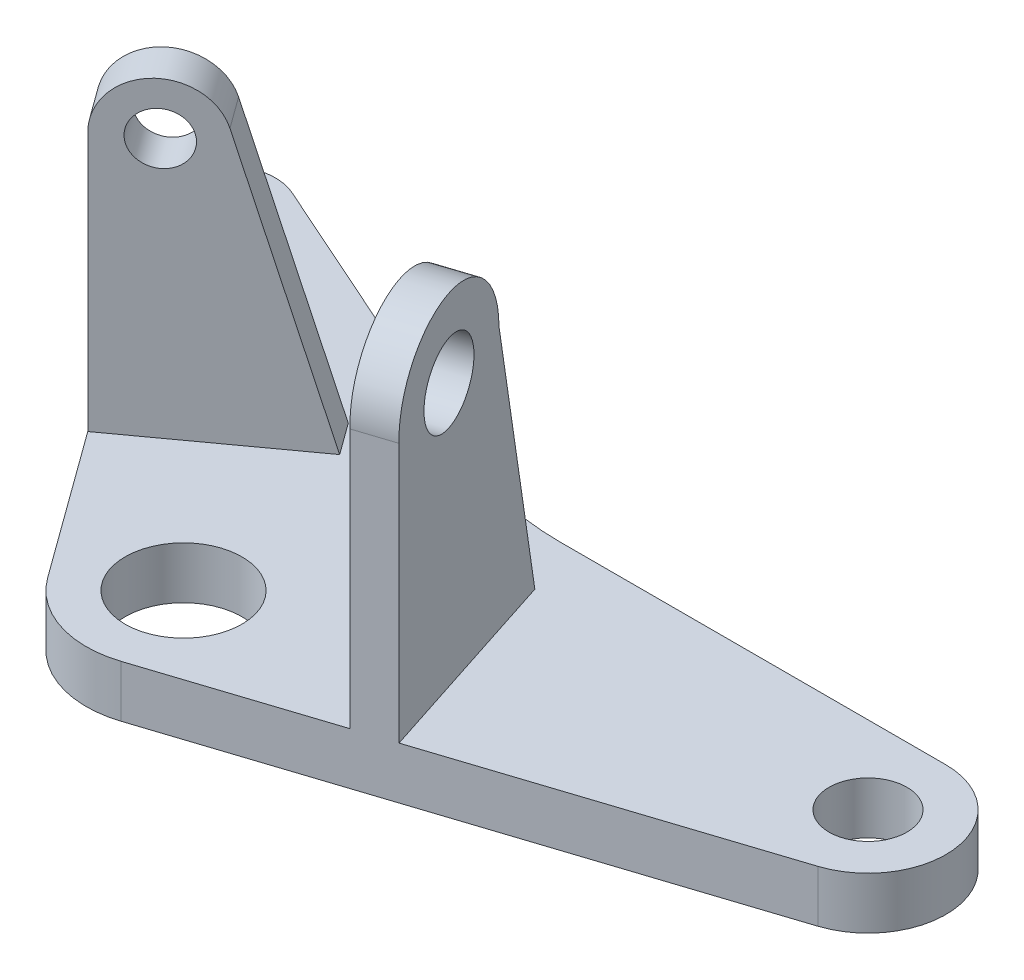
ISO-10303-21;
HEADER;
FILE_DESCRIPTION(('STEP AP214'),'2;1');
FILE_NAME('part.step','',(''),(''),'','','');
FILE_SCHEMA(('AUTOMOTIVE_DESIGN { 1 0 10303 214 1 1 1 1 }'));
ENDSEC;
DATA;
#1=APPLICATION_CONTEXT('core data for automotive mechanical design processes');
#2=APPLICATION_PROTOCOL_DEFINITION('international standard','automotive_design',2000,#1);
#3=PRODUCT_CONTEXT('',#1,'mechanical');
#4=PRODUCT('Part','Part','',(#3));
#5=PRODUCT_RELATED_PRODUCT_CATEGORY('part','',(#4));
#6=PRODUCT_DEFINITION_FORMATION('','',#4);
#7=PRODUCT_DEFINITION_CONTEXT('part definition',#1,'design');
#8=PRODUCT_DEFINITION('design','',#6,#7);
#9=PRODUCT_DEFINITION_SHAPE('','',#8);
#10=(LENGTH_UNIT() NAMED_UNIT(*) SI_UNIT(.MILLI.,.METRE.));
#11=(NAMED_UNIT(*) PLANE_ANGLE_UNIT() SI_UNIT($,.RADIAN.));
#12=(NAMED_UNIT(*) SI_UNIT($,.STERADIAN.) SOLID_ANGLE_UNIT());
#13=UNCERTAINTY_MEASURE_WITH_UNIT(LENGTH_MEASURE(1.E-05),#10,'distance_accuracy_value','');
#14=(GEOMETRIC_REPRESENTATION_CONTEXT(3) GLOBAL_UNCERTAINTY_ASSIGNED_CONTEXT((#13)) GLOBAL_UNIT_ASSIGNED_CONTEXT((#10,
#11,#12)) REPRESENTATION_CONTEXT('',''));
#15=CARTESIAN_POINT('',(0.,0.,0.));
#16=DIRECTION('',(0.,0.,1.));
#17=DIRECTION('',(1.,0.,0.));
#18=AXIS2_PLACEMENT_3D('',#15,#16,#17);
#19=CARTESIAN_POINT('',(74.248108018003,7.99999999999999,12.));
#20=DIRECTION('',(0.,-1.,0.));
#21=DIRECTION('',(0.,0.,-1.));
#22=AXIS2_PLACEMENT_3D('',#19,#20,#21);
#23=CYLINDRICAL_SURFACE('',#22,12.);
#24=CARTESIAN_POINT('',(74.248108018003,0.,12.));
#25=DIRECTION('',(0.,1.,0.));
#26=DIRECTION('',(0.,0.,1.));
#27=AXIS2_PLACEMENT_3D('',#24,#25,#26);
#28=CIRCLE('',#27,12.);
#29=CARTESIAN_POINT('',(77.9563119505023,0.,23.4126781955419));
#30=VERTEX_POINT('',#29);
#31=CARTESIAN_POINT('',(74.248108018003,0.,0.));
#32=VERTEX_POINT('',#31);
#33=EDGE_CURVE('E296',#30,#32,#28,.T.);
#34=ORIENTED_EDGE('',*,*,#33,.T.);
#35=DIRECTION('',(0.,-1.,0.));
#36=VECTOR('',#35,1.);
#37=CARTESIAN_POINT('',(74.248108018003,7.99999999999999,0.));
#38=LINE('',#37,#36);
#39=CARTESIAN_POINT('',(74.248108018003,7.99999999999999,0.));
#40=VERTEX_POINT('',#39);
#41=EDGE_CURVE('E11',#40,#32,#38,.T.);
#42=ORIENTED_EDGE('',*,*,#41,.F.);
#43=CARTESIAN_POINT('',(74.248108018003,7.99999999999999,12.));
#44=DIRECTION('',(0.,1.,0.));
#45=DIRECTION('',(0.,0.,1.));
#46=AXIS2_PLACEMENT_3D('',#43,#44,#45);
#47=CIRCLE('',#46,12.);
#48=CARTESIAN_POINT('',(77.9563119505023,7.99999999999999,23.4126781955419));
#49=VERTEX_POINT('',#48);
#50=EDGE_CURVE('E266',#49,#40,#47,.T.);
#51=ORIENTED_EDGE('',*,*,#50,.F.);
#52=DIRECTION('',(0.,-1.,0.));
#53=VECTOR('',#52,1.);
#54=CARTESIAN_POINT('',(77.9563119505023,7.99999999999999,23.4126781955419));
#55=LINE('',#54,#53);
#56=EDGE_CURVE('E295',#49,#30,#55,.T.);
#57=ORIENTED_EDGE('',*,*,#56,.T.);
#58=EDGE_LOOP('',(#34,#42,#51,#57));
#59=FACE_BOUND('',#58,.T.);
#60=ADVANCED_FACE('F43',(#59),#23,.T.);
#61=CARTESIAN_POINT('',(14.7736770317049,7.99999999999999,0.));
#62=DIRECTION('',(0.,0.,1.));
#63=DIRECTION('',(1.,0.,0.));
#64=AXIS2_PLACEMENT_3D('',#61,#62,#63);
#65=PLANE('',#64);
#66=DIRECTION('',(-1.,0.,0.));
#67=VECTOR('',#66,1.);
#68=CARTESIAN_POINT('',(14.7736770317049,0.,0.));
#69=LINE('',#68,#67);
#70=CARTESIAN_POINT('',(14.7736770317049,0.,1.94289029309402E-13));
#71=VERTEX_POINT('',#70);
#72=EDGE_CURVE('E300',#32,#71,#69,.T.);
#73=ORIENTED_EDGE('',*,*,#72,.T.);
#74=DIRECTION('',(0.,-1.,0.));
#75=VECTOR('',#74,1.);
#76=CARTESIAN_POINT('',(14.7736770317049,7.99999999999999,1.94289029309402E-13));
#77=LINE('',#76,#75);
#78=CARTESIAN_POINT('',(14.7736770317049,7.99999999999999,1.94289029309402E-13));
#79=VERTEX_POINT('',#78);
#80=EDGE_CURVE('E52',#79,#71,#77,.T.);
#81=ORIENTED_EDGE('',*,*,#80,.F.);
#82=DIRECTION('',(-1.,0.,0.));
#83=VECTOR('',#82,1.);
#84=CARTESIAN_POINT('',(14.7736770317049,7.99999999999999,0.));
#85=LINE('',#84,#83);
#86=EDGE_CURVE('E270',#40,#79,#85,.T.);
#87=ORIENTED_EDGE('',*,*,#86,.F.);
#88=ORIENTED_EDGE('',*,*,#41,.T.);
#89=EDGE_LOOP('',(#73,#81,#87,#88));
#90=FACE_BOUND('',#89,.T.);
#91=ADVANCED_FACE('F377',(#90),#65,.F.);
#92=CARTESIAN_POINT('',(14.7736770317058,7.99999999999999,-42.));
#93=DIRECTION('',(0.,-1.,0.));
#94=DIRECTION('',(0.,0.,-1.));
#95=AXIS2_PLACEMENT_3D('',#92,#93,#94);
#96=CYLINDRICAL_SURFACE('',#95,42.0000000000002);
#97=CARTESIAN_POINT('',(14.7736770317058,0.,-42.));
#98=DIRECTION('',(0.,-1.,0.));
#99=DIRECTION('',(0.,0.,-1.));
#100=AXIS2_PLACEMENT_3D('',#97,#98,#99);
#101=CIRCLE('',#100,42.0000000000002);
#102=CARTESIAN_POINT('',(-2.30926197747905,0.,-3.6310907790109));
#103=VERTEX_POINT('',#102);
#104=EDGE_CURVE('E303',#71,#103,#101,.T.);
#105=ORIENTED_EDGE('',*,*,#104,.T.);
#106=DIRECTION('',(0.,-1.,0.));
#107=VECTOR('',#106,1.);
#108=CARTESIAN_POINT('',(-2.30926197747905,7.99999999999999,-3.6310907790109));
#109=LINE('',#108,#107);
#110=CARTESIAN_POINT('',(-2.30926197747905,7.99999999999999,-3.6310907790109));
#111=VERTEX_POINT('',#110);
#112=EDGE_CURVE('E339',#111,#103,#109,.T.);
#113=ORIENTED_EDGE('',*,*,#112,.F.);
#114=CARTESIAN_POINT('',(14.7736770317058,7.99999999999999,-42.));
#115=DIRECTION('',(0.,-1.,0.));
#116=DIRECTION('',(0.,0.,-1.));
#117=AXIS2_PLACEMENT_3D('',#114,#115,#116);
#118=CIRCLE('',#117,42.0000000000002);
#119=EDGE_CURVE('E274',#79,#111,#118,.T.);
#120=ORIENTED_EDGE('',*,*,#119,.F.);
#121=ORIENTED_EDGE('',*,*,#80,.T.);
#122=EDGE_LOOP('',(#105,#113,#120,#121));
#123=FACE_BOUND('',#122,.T.);
#124=ADVANCED_FACE('F382',(#123),#96,.F.);
#125=CARTESIAN_POINT('',(-2.30926197747905,7.99999999999999,-3.6310907790109));
#126=DIRECTION('',(-0.406736643075808,0.,0.913545457642598));
#127=DIRECTION('',(0.913545457642598,0.,0.406736643075808));
#128=AXIS2_PLACEMENT_3D('',#125,#126,#127);
#129=PLANE('',#128);
#130=DIRECTION('',(-0.913545457642598,0.,-0.406736643075808));
#131=VECTOR('',#130,1.);
#132=CARTESIAN_POINT('',(-2.30926197747905,0.,-3.6310907790109));
#133=LINE('',#132,#131);
#134=CARTESIAN_POINT('',(-52.4979988373905,0.,-25.9765561084458));
#135=VERTEX_POINT('',#134);
#136=EDGE_CURVE('E306',#103,#135,#133,.T.);
#137=ORIENTED_EDGE('',*,*,#136,.T.);
#138=DIRECTION('',(0.,-1.,0.));
#139=VECTOR('',#138,1.);
#140=CARTESIAN_POINT('',(-52.4979988373905,7.99999999999999,-25.9765561084458));
#141=LINE('',#140,#139);
#142=CARTESIAN_POINT('',(-52.4979988373905,7.99999999999999,-25.9765561084458));
#143=VERTEX_POINT('',#142);
#144=EDGE_CURVE('E335',#143,#135,#141,.T.);
#145=ORIENTED_EDGE('',*,*,#144,.F.);
#146=DIRECTION('',(-0.913545457642598,0.,-0.406736643075808));
#147=VECTOR('',#146,1.);
#148=CARTESIAN_POINT('',(-2.30926197747905,7.99999999999999,-3.6310907790109));
#149=LINE('',#148,#147);
#150=EDGE_CURVE('E277',#111,#143,#149,.T.);
#151=ORIENTED_EDGE('',*,*,#150,.F.);
#152=ORIENTED_EDGE('',*,*,#112,.T.);
#153=EDGE_LOOP('',(#137,#145,#151,#152));
#154=FACE_BOUND('',#153,.T.);
#155=ADVANCED_FACE('F421',(#154),#129,.F.);
#156=CARTESIAN_POINT('',(-55.751891981997,7.99999999999999,-18.6681924473051));
#157=DIRECTION('',(0.,-1.,0.));
#158=DIRECTION('',(0.,0.,-1.));
#159=AXIS2_PLACEMENT_3D('',#156,#157,#158);
#160=CYLINDRICAL_SURFACE('',#159,8.);
#161=CARTESIAN_POINT('',(-55.751891981997,0.,-18.6681924473051));
#162=DIRECTION('',(0.,1.,0.));
#163=DIRECTION('',(0.,0.,1.));
#164=AXIS2_PLACEMENT_3D('',#161,#162,#163);
#165=CIRCLE('',#164,8.);
#166=CARTESIAN_POINT('',(-62.2240279369966,0.,-13.9659104289653));
#167=VERTEX_POINT('',#166);
#168=EDGE_CURVE('E309',#135,#167,#165,.T.);
#169=ORIENTED_EDGE('',*,*,#168,.T.);
#170=DIRECTION('',(0.,-1.,0.));
#171=VECTOR('',#170,1.);
#172=CARTESIAN_POINT('',(-62.2240279369966,7.99999999999999,-13.9659104289653));
#173=LINE('',#172,#171);
#174=CARTESIAN_POINT('',(-62.2240279369966,7.99999999999999,-13.9659104289653));
#175=VERTEX_POINT('',#174);
#176=EDGE_CURVE('E331',#175,#167,#173,.T.);
#177=ORIENTED_EDGE('',*,*,#176,.F.);
#178=CARTESIAN_POINT('',(-55.751891981997,7.99999999999999,-18.6681924473051));
#179=DIRECTION('',(0.,1.,0.));
#180=DIRECTION('',(0.,0.,1.));
#181=AXIS2_PLACEMENT_3D('',#178,#179,#180);
#182=CIRCLE('',#181,8.);
#183=EDGE_CURVE('E280',#143,#175,#182,.T.);
#184=ORIENTED_EDGE('',*,*,#183,.F.);
#185=ORIENTED_EDGE('',*,*,#144,.T.);
#186=EDGE_LOOP('',(#169,#177,#184,#185));
#187=FACE_BOUND('',#186,.T.);
#188=ADVANCED_FACE('F417',(#187),#160,.T.);
#189=CARTESIAN_POINT('',(-62.2240279369966,7.99999999999999,-13.9659104289653));
#190=DIRECTION('',(0.809016994374949,0.,-0.587785252292471));
#191=DIRECTION('',(-0.587785252292471,0.,-0.809016994374949));
#192=AXIS2_PLACEMENT_3D('',#189,#190,#191);
#193=PLANE('',#192);
#194=DIRECTION('',(0.587785252292471,0.,0.809016994374949));
#195=VECTOR('',#194,1.);
#196=CARTESIAN_POINT('',(-62.2240279369966,0.,-13.9659104289653));
#197=LINE('',#196,#195);
#198=CARTESIAN_POINT('',(-19.8871468976212,0.,44.30580720277));
#199=VERTEX_POINT('',#198);
#200=EDGE_CURVE('E312',#167,#199,#197,.T.);
#201=ORIENTED_EDGE('',*,*,#200,.T.);
#202=DIRECTION('',(0.,-1.,0.));
#203=VECTOR('',#202,1.);
#204=CARTESIAN_POINT('',(-19.8871468976212,7.99999999999999,44.30580720277));
#205=LINE('',#204,#203);
#206=CARTESIAN_POINT('',(-19.8871468976212,7.99999999999999,44.30580720277));
#207=VERTEX_POINT('',#206);
#208=EDGE_CURVE('E327',#207,#199,#205,.T.);
#209=ORIENTED_EDGE('',*,*,#208,.F.);
#210=DIRECTION('',(0.587785252292471,0.,0.809016994374949));
#211=VECTOR('',#210,1.);
#212=CARTESIAN_POINT('',(-62.2240279369966,7.99999999999999,-13.9659104289653));
#213=LINE('',#212,#211);
#214=CARTESIAN_POINT('',(-36.3451339618104,7.99999999999999,21.6533313602715));
#215=VERTEX_POINT('',#214);
#216=EDGE_CURVE('E283',#215,#207,#213,.T.);
#217=ORIENTED_EDGE('',*,*,#216,.F.);
#218=DIRECTION('',(0.,-1.,0.));
#219=VECTOR('',#218,1.);
#220=CARTESIAN_POINT('',(-36.3451339618104,46.,21.6533313602715));
#221=LINE('',#220,#219);
#222=CARTESIAN_POINT('',(-36.3451339618104,48.,21.6533313602715));
#223=VERTEX_POINT('',#222);
#224=EDGE_CURVE('E183',#223,#215,#221,.T.);
#225=ORIENTED_EDGE('',*,*,#224,.F.);
#226=DIRECTION('',(-0.587785252292472,0.,-0.809016994374949));
#227=VECTOR('',#226,1.);
#228=CARTESIAN_POINT('',(-36.3451339618104,48.,21.6533313602715));
#229=LINE('',#228,#227);
#230=CARTESIAN_POINT('',(-39.8718454755652,48.,16.7992293940218));
#231=VERTEX_POINT('',#230);
#232=EDGE_CURVE('E177',#223,#231,#229,.T.);
#233=ORIENTED_EDGE('',*,*,#232,.T.);
#234=DIRECTION('',(0.,-1.,0.));
#235=VECTOR('',#234,1.);
#236=CARTESIAN_POINT('',(-39.8718454755652,7.99999999999999,16.7992293940218));
#237=LINE('',#236,#235);
#238=CARTESIAN_POINT('',(-39.8718454755652,7.99999999999999,16.7992293940218));
#239=VERTEX_POINT('',#238);
#240=EDGE_CURVE('E197',#231,#239,#237,.T.);
#241=ORIENTED_EDGE('',*,*,#240,.T.);
#242=EDGE_CURVE('E284',#175,#239,#213,.T.);
#243=ORIENTED_EDGE('',*,*,#242,.F.);
#244=ORIENTED_EDGE('',*,*,#176,.T.);
#245=EDGE_LOOP('',(#201,#209,#217,#225,#233,#241,#243,#244));
#246=FACE_BOUND('',#245,.T.);
#247=ADVANCED_FACE('F412',(#246),#193,.F.);
#248=CARTESIAN_POINT('',(-7.75189198199698,7.99999999999999,35.489028418383));
#249=DIRECTION('',(0.,-1.,0.));
#250=DIRECTION('',(0.,0.,-1.));
#251=AXIS2_PLACEMENT_3D('',#248,#249,#250);
#252=CYLINDRICAL_SURFACE('',#251,15.);
#253=CARTESIAN_POINT('',(-7.75189198199698,0.,35.489028418383));
#254=DIRECTION('',(0.,1.,0.));
#255=DIRECTION('',(0.,0.,1.));
#256=AXIS2_PLACEMENT_3D('',#253,#254,#255);
#257=CIRCLE('',#256,15.);
#258=CARTESIAN_POINT('',(-3.11663706637285,0.,49.7548761628103));
#259=VERTEX_POINT('',#258);
#260=EDGE_CURVE('E315',#199,#259,#257,.T.);
#261=ORIENTED_EDGE('',*,*,#260,.T.);
#262=DIRECTION('',(0.,-1.,0.));
#263=VECTOR('',#262,1.);
#264=CARTESIAN_POINT('',(-3.11663706637285,7.99999999999999,49.7548761628103));
#265=LINE('',#264,#263);
#266=CARTESIAN_POINT('',(-3.11663706637285,7.99999999999999,49.7548761628103));
#267=VERTEX_POINT('',#266);
#268=EDGE_CURVE('E323',#267,#259,#265,.T.);
#269=ORIENTED_EDGE('',*,*,#268,.F.);
#270=CARTESIAN_POINT('',(-7.75189198199698,7.99999999999999,35.489028418383));
#271=DIRECTION('',(0.,1.,0.));
#272=DIRECTION('',(0.,0.,1.));
#273=AXIS2_PLACEMENT_3D('',#270,#271,#272);
#274=CIRCLE('',#273,15.);
#275=EDGE_CURVE('E287',#207,#267,#274,.T.);
#276=ORIENTED_EDGE('',*,*,#275,.F.);
#277=ORIENTED_EDGE('',*,*,#208,.T.);
#278=EDGE_LOOP('',(#261,#269,#276,#277));
#279=FACE_BOUND('',#278,.T.);
#280=ADVANCED_FACE('F407',(#279),#252,.T.);
#281=CARTESIAN_POINT('',(77.9563119505023,7.99999999999999,23.4126781955419));
#282=DIRECTION('',(-0.309016994374942,0.,-0.951056516295156));
#283=DIRECTION('',(-0.951056516295156,0.,0.309016994374942));
#284=AXIS2_PLACEMENT_3D('',#281,#282,#283);
#285=PLANE('',#284);
#286=DIRECTION('',(0.951056516295155,0.,-0.309016994374942));
#287=VECTOR('',#286,1.);
#288=CARTESIAN_POINT('',(77.9563119505023,0.,23.4126781955419));
#289=LINE('',#288,#287);
#290=EDGE_CURVE('E271',#259,#30,#289,.T.);
#291=ORIENTED_EDGE('',*,*,#290,.T.);
#292=ORIENTED_EDGE('',*,*,#56,.F.);
#293=DIRECTION('',(0.951056516295155,0.,-0.309016994374942));
#294=VECTOR('',#293,1.);
#295=CARTESIAN_POINT('',(77.9563119505023,7.99999999999999,23.4126781955419));
#296=LINE('',#295,#294);
#297=CARTESIAN_POINT('',(29.2192844876624,7.99999999999999,39.2482983540623));
#298=VERTEX_POINT('',#297);
#299=EDGE_CURVE('E290',#298,#49,#296,.T.);
#300=ORIENTED_EDGE('',*,*,#299,.F.);
#301=DIRECTION('',(0.,-1.,0.));
#302=VECTOR('',#301,1.);
#303=CARTESIAN_POINT('',(29.2192844876624,7.99999999999999,39.2482983540623));
#304=LINE('',#303,#302);
#305=CARTESIAN_POINT('',(29.2192844876624,48.,39.2482983540623));
#306=VERTEX_POINT('',#305);
#307=EDGE_CURVE('E219',#306,#298,#304,.T.);
#308=ORIENTED_EDGE('',*,*,#307,.F.);
#309=DIRECTION('',(0.951056516295155,0.,-0.309016994374942));
#310=VECTOR('',#309,1.);
#311=CARTESIAN_POINT('',(23.5129453898915,48.,41.102400320312));
#312=LINE('',#311,#310);
#313=CARTESIAN_POINT('',(23.5129453898915,48.,41.102400320312));
#314=VERTEX_POINT('',#313);
#315=EDGE_CURVE('E244',#314,#306,#312,.T.);
#316=ORIENTED_EDGE('',*,*,#315,.F.);
#317=DIRECTION('',(0.,-1.,0.));
#318=VECTOR('',#317,1.);
#319=CARTESIAN_POINT('',(23.5129453898915,7.99999999999999,41.102400320312));
#320=LINE('',#319,#318);
#321=CARTESIAN_POINT('',(23.5129453898915,7.99999999999999,41.102400320312));
#322=VERTEX_POINT('',#321);
#323=EDGE_CURVE('E227',#314,#322,#320,.T.);
#324=ORIENTED_EDGE('',*,*,#323,.T.);
#325=EDGE_CURVE('E291',#267,#322,#296,.T.);
#326=ORIENTED_EDGE('',*,*,#325,.F.);
#327=ORIENTED_EDGE('',*,*,#268,.T.);
#328=EDGE_LOOP('',(#291,#292,#300,#308,#316,#324,#326,#327));
#329=FACE_BOUND('',#328,.T.);
#330=ADVANCED_FACE('F402',(#329),#285,.F.);
#331=CARTESIAN_POINT('',(74.248108018003,7.99999999999999,12.));
#332=DIRECTION('',(0.,1.,0.));
#333=DIRECTION('',(0.,0.,1.));
#334=AXIS2_PLACEMENT_3D('',#331,#332,#333);
#335=PLANE('',#334);
#336=DIRECTION('',(0.809016994374949,0.,-0.587785252292472));
#337=VECTOR('',#336,1.);
#338=CARTESIAN_POINT('',(-36.3451339618104,7.99999999999999,21.6533313602715));
#339=LINE('',#338,#337);
#340=CARTESIAN_POINT('',(-13.8607630185064,7.99999999999999,5.31747965451314));
#341=VERTEX_POINT('',#340);
#342=EDGE_CURVE('E165',#215,#341,#339,.T.);
#343=ORIENTED_EDGE('',*,*,#342,.F.);
#344=ORIENTED_EDGE('',*,*,#216,.T.);
#345=ORIENTED_EDGE('',*,*,#275,.T.);
#346=ORIENTED_EDGE('',*,*,#325,.T.);
#347=DIRECTION('',(-0.309016994374942,0.,-0.951056516295155));
#348=VECTOR('',#347,1.);
#349=CARTESIAN_POINT('',(23.5129453898915,7.99999999999999,41.102400320312));
#350=LINE('',#349,#348);
#351=CARTESIAN_POINT('',(13.4383785467368,7.99999999999999,10.0960718029625));
#352=VERTEX_POINT('',#351);
#353=EDGE_CURVE('E214',#322,#352,#350,.T.);
#354=ORIENTED_EDGE('',*,*,#353,.T.);
#355=DIRECTION('',(0.951056516295155,0.,-0.309016994374942));
#356=VECTOR('',#355,1.);
#357=CARTESIAN_POINT('',(13.4383785467368,7.99999999999999,10.0960718029625));
#358=LINE('',#357,#356);
#359=CARTESIAN_POINT('',(19.1447176445077,7.99999999999999,8.24196983671281));
#360=VERTEX_POINT('',#359);
#361=EDGE_CURVE('E231',#352,#360,#358,.T.);
#362=ORIENTED_EDGE('',*,*,#361,.T.);
#363=DIRECTION('',(-0.309016994374942,0.,-0.951056516295155));
#364=VECTOR('',#363,1.);
#365=CARTESIAN_POINT('',(29.2192844876624,7.99999999999999,39.2482983540623));
#366=LINE('',#365,#364);
#367=EDGE_CURVE('E210',#298,#360,#366,.T.);
#368=ORIENTED_EDGE('',*,*,#367,.F.);
#369=ORIENTED_EDGE('',*,*,#299,.T.);
#370=ORIENTED_EDGE('',*,*,#50,.T.);
#371=ORIENTED_EDGE('',*,*,#86,.T.);
#372=ORIENTED_EDGE('',*,*,#119,.T.);
#373=ORIENTED_EDGE('',*,*,#150,.T.);
#374=ORIENTED_EDGE('',*,*,#183,.T.);
#375=ORIENTED_EDGE('',*,*,#242,.T.);
#376=DIRECTION('',(0.809016994374949,0.,-0.587785252292472));
#377=VECTOR('',#376,1.);
#378=CARTESIAN_POINT('',(-39.8718454755652,7.99999999999999,16.7992293940218));
#379=LINE('',#378,#377);
#380=CARTESIAN_POINT('',(-17.3874745322612,7.99999999999999,0.463377688263457));
#381=VERTEX_POINT('',#380);
#382=EDGE_CURVE('E65',#239,#381,#379,.T.);
#383=ORIENTED_EDGE('',*,*,#382,.T.);
#384=DIRECTION('',(-0.587785252292472,0.,-0.809016994374949));
#385=VECTOR('',#384,1.);
#386=CARTESIAN_POINT('',(-13.8607630185064,7.99999999999999,5.31747965451315));
#387=LINE('',#386,#385);
#388=EDGE_CURVE('E60',#341,#381,#387,.T.);
#389=ORIENTED_EDGE('',*,*,#388,.F.);
#390=EDGE_LOOP('',(#343,#344,#345,#346,#354,#362,#368,#369,#370,#371,#372,#373,#374,#375,#383,#389));
#391=FACE_BOUND('',#390,.T.);
#392=CARTESIAN_POINT('',(74.248108018003,7.99999999999999,12.));
#393=DIRECTION('',(0.,1.,0.));
#394=DIRECTION('',(0.,0.,1.));
#395=AXIS2_PLACEMENT_3D('',#392,#393,#394);
#396=CIRCLE('',#395,6.);
#397=CARTESIAN_POINT('',(74.248108018003,7.99999999999999,18.));
#398=VERTEX_POINT('',#397);
#399=EDGE_CURVE('E254',#398,#398,#396,.T.);
#400=ORIENTED_EDGE('',*,*,#399,.F.);
#401=EDGE_LOOP('',(#400));
#402=FACE_BOUND('',#401,.T.);
#403=CARTESIAN_POINT('',(-55.751891981997,7.99999999999999,-18.6681924473051));
#404=DIRECTION('',(0.,1.,0.));
#405=DIRECTION('',(0.,0.,1.));
#406=AXIS2_PLACEMENT_3D('',#403,#404,#405);
#407=CIRCLE('',#406,4.00000000000001);
#408=CARTESIAN_POINT('',(-55.751891981997,7.99999999999999,-14.6681924473051));
#409=VERTEX_POINT('',#408);
#410=EDGE_CURVE('E259',#409,#409,#407,.T.);
#411=ORIENTED_EDGE('',*,*,#410,.F.);
#412=EDGE_LOOP('',(#411));
#413=FACE_BOUND('',#412,.T.);
#414=CARTESIAN_POINT('',(-7.75189198199698,7.99999999999999,35.489028418383));
#415=DIRECTION('',(0.,1.,0.));
#416=DIRECTION('',(0.,0.,1.));
#417=AXIS2_PLACEMENT_3D('',#414,#415,#416);
#418=CIRCLE('',#417,9.);
#419=CARTESIAN_POINT('',(-7.75189198199698,7.99999999999999,44.489028418383));
#420=VERTEX_POINT('',#419);
#421=EDGE_CURVE('E247',#420,#420,#418,.T.);
#422=ORIENTED_EDGE('',*,*,#421,.F.);
#423=EDGE_LOOP('',(#422));
#424=FACE_BOUND('',#423,.T.);
#425=ADVANCED_FACE('F395',(#391,#402,#413,#424),#335,.T.);
#426=CARTESIAN_POINT('',(74.248108018003,0.,12.));
#427=DIRECTION('',(0.,1.,0.));
#428=DIRECTION('',(0.,0.,1.));
#429=AXIS2_PLACEMENT_3D('',#426,#427,#428);
#430=PLANE('',#429);
#431=CARTESIAN_POINT('',(74.248108018003,0.,12.));
#432=DIRECTION('',(0.,1.,0.));
#433=DIRECTION('',(0.,0.,1.));
#434=AXIS2_PLACEMENT_3D('',#431,#432,#433);
#435=CIRCLE('',#434,6.);
#436=CARTESIAN_POINT('',(74.248108018003,0.,18.));
#437=VERTEX_POINT('',#436);
#438=EDGE_CURVE('E46',#437,#437,#435,.T.);
#439=ORIENTED_EDGE('',*,*,#438,.T.);
#440=EDGE_LOOP('',(#439));
#441=FACE_BOUND('',#440,.T.);
#442=CARTESIAN_POINT('',(-55.751891981997,0.,-18.6681924473051));
#443=DIRECTION('',(0.,1.,0.));
#444=DIRECTION('',(0.,0.,1.));
#445=AXIS2_PLACEMENT_3D('',#442,#443,#444);
#446=CIRCLE('',#445,4.00000000000001);
#447=CARTESIAN_POINT('',(-55.751891981997,0.,-14.6681924473051));
#448=VERTEX_POINT('',#447);
#449=EDGE_CURVE('E348',#448,#448,#446,.T.);
#450=ORIENTED_EDGE('',*,*,#449,.T.);
#451=EDGE_LOOP('',(#450));
#452=FACE_BOUND('',#451,.T.);
#453=CARTESIAN_POINT('',(-7.75189198199698,0.,35.489028418383));
#454=DIRECTION('',(0.,1.,0.));
#455=DIRECTION('',(0.,0.,1.));
#456=AXIS2_PLACEMENT_3D('',#453,#454,#455);
#457=CIRCLE('',#456,9.);
#458=CARTESIAN_POINT('',(-7.75189198199698,0.,44.489028418383));
#459=VERTEX_POINT('',#458);
#460=EDGE_CURVE('E258',#459,#459,#457,.T.);
#461=ORIENTED_EDGE('',*,*,#460,.T.);
#462=EDGE_LOOP('',(#461));
#463=FACE_BOUND('',#462,.T.);
#464=ORIENTED_EDGE('',*,*,#33,.F.);
#465=ORIENTED_EDGE('',*,*,#290,.F.);
#466=ORIENTED_EDGE('',*,*,#260,.F.);
#467=ORIENTED_EDGE('',*,*,#200,.F.);
#468=ORIENTED_EDGE('',*,*,#168,.F.);
#469=ORIENTED_EDGE('',*,*,#136,.F.);
#470=ORIENTED_EDGE('',*,*,#104,.F.);
#471=ORIENTED_EDGE('',*,*,#72,.F.);
#472=EDGE_LOOP('',(#464,#465,#466,#467,#468,#469,#470,#471));
#473=FACE_BOUND('',#472,.T.);
#474=ADVANCED_FACE('F357',(#441,#452,#463,#473),#430,.F.);
#475=CARTESIAN_POINT('',(-7.75189198199698,-26.,35.489028418383));
#476=DIRECTION('',(0.,1.,0.));
#477=DIRECTION('',(0.,0.,1.));
#478=AXIS2_PLACEMENT_3D('',#475,#476,#477);
#479=CYLINDRICAL_SURFACE('',#478,9.);
#480=ORIENTED_EDGE('',*,*,#421,.T.);
#481=EDGE_LOOP('',(#480));
#482=FACE_BOUND('',#481,.T.);
#483=ORIENTED_EDGE('',*,*,#460,.F.);
#484=EDGE_LOOP('',(#483));
#485=FACE_BOUND('',#484,.T.);
#486=ADVANCED_FACE('F372',(#482,#485),#479,.F.);
#487=CARTESIAN_POINT('',(-55.751891981997,-26.,-18.6681924473051));
#488=DIRECTION('',(0.,1.,0.));
#489=DIRECTION('',(0.,0.,1.));
#490=AXIS2_PLACEMENT_3D('',#487,#488,#489);
#491=CYLINDRICAL_SURFACE('',#490,4.00000000000001);
#492=ORIENTED_EDGE('',*,*,#410,.T.);
#493=EDGE_LOOP('',(#492));
#494=FACE_BOUND('',#493,.T.);
#495=ORIENTED_EDGE('',*,*,#449,.F.);
#496=EDGE_LOOP('',(#495));
#497=FACE_BOUND('',#496,.T.);
#498=ADVANCED_FACE('F362',(#494,#497),#491,.F.);
#499=CARTESIAN_POINT('',(74.248108018003,-26.,12.));
#500=DIRECTION('',(0.,1.,0.));
#501=DIRECTION('',(0.,0.,1.));
#502=AXIS2_PLACEMENT_3D('',#499,#500,#501);
#503=CYLINDRICAL_SURFACE('',#502,6.);
#504=ORIENTED_EDGE('',*,*,#399,.T.);
#505=EDGE_LOOP('',(#504));
#506=FACE_BOUND('',#505,.T.);
#507=ORIENTED_EDGE('',*,*,#438,.F.);
#508=EDGE_LOOP('',(#507));
#509=FACE_BOUND('',#508,.T.);
#510=ADVANCED_FACE('F359',(#506,#509),#503,.F.);
#511=CARTESIAN_POINT('',(19.8082615055786,48.5227399044099,29.7005557191235));
#512=DIRECTION('',(0.951056516295155,0.,-0.309016994374942));
#513=DIRECTION('',(-0.309016994374942,0.,-0.951056516295155));
#514=AXIS2_PLACEMENT_3D('',#511,#512,#513);
#515=CYLINDRICAL_SURFACE('',#514,12.);
#516=CARTESIAN_POINT('',(25.5146006033495,48.5227399044099,27.8464537528739));
#517=DIRECTION('',(0.951056516295155,0.,-0.309016994374942));
#518=DIRECTION('',(-0.309016994374942,0.,-0.951056516295155));
#519=AXIS2_PLACEMENT_3D('',#516,#517,#518);
#520=CIRCLE('',#519,12.);
#521=CARTESIAN_POINT('',(21.8063966708502,48.5227399044099,16.433775557332));
#522=VERTEX_POINT('',#521);
#523=EDGE_CURVE('E238',#522,#306,#520,.T.);
#524=ORIENTED_EDGE('',*,*,#523,.F.);
#525=DIRECTION('',(0.951056516295155,0.,-0.309016994374942));
#526=VECTOR('',#525,1.);
#527=CARTESIAN_POINT('',(16.1000575730793,48.5227399044099,18.2878775235816));
#528=LINE('',#527,#526);
#529=CARTESIAN_POINT('',(16.1000575730793,48.5227399044099,18.2878775235816));
#530=VERTEX_POINT('',#529);
#531=EDGE_CURVE('E248',#530,#522,#528,.T.);
#532=ORIENTED_EDGE('',*,*,#531,.F.);
#533=CARTESIAN_POINT('',(19.8082615055786,48.5227399044099,29.7005557191235));
#534=DIRECTION('',(0.951056516295155,0.,-0.309016994374942));
#535=DIRECTION('',(-0.309016994374942,0.,-0.951056516295155));
#536=AXIS2_PLACEMENT_3D('',#533,#534,#535);
#537=CIRCLE('',#536,12.);
#538=EDGE_CURVE('E223',#530,#314,#537,.T.);
#539=ORIENTED_EDGE('',*,*,#538,.T.);
#540=ORIENTED_EDGE('',*,*,#315,.T.);
#541=EDGE_LOOP('',(#524,#532,#539,#540));
#542=FACE_BOUND('',#541,.T.);
#543=ADVANCED_FACE('F361',(#542),#515,.T.);
#544=CARTESIAN_POINT('',(13.4383785467368,7.99999999999999,10.0960718029625));
#545=DIRECTION('',(-0.302264231633821,0.20791169081776,-0.930273649576358));
#546=DIRECTION('',(-0.951056516295155,0.,0.309016994374942));
#547=AXIS2_PLACEMENT_3D('',#544,#545,#546);
#548=PLANE('',#547);
#549=DIRECTION('',(0.0642482457919164,0.978147600733806,0.197735768366174));
#550=VECTOR('',#549,1.);
#551=CARTESIAN_POINT('',(19.1447176445077,7.99999999999999,8.24196983671281));
#552=LINE('',#551,#550);
#553=EDGE_CURVE('E234',#360,#522,#552,.T.);
#554=ORIENTED_EDGE('',*,*,#553,.F.);
#555=ORIENTED_EDGE('',*,*,#361,.F.);
#556=DIRECTION('',(0.0642482457919164,0.978147600733806,0.197735768366174));
#557=VECTOR('',#556,1.);
#558=CARTESIAN_POINT('',(13.4383785467368,7.99999999999999,10.0960718029625));
#559=LINE('',#558,#557);
#560=EDGE_CURVE('E218',#352,#530,#559,.T.);
#561=ORIENTED_EDGE('',*,*,#560,.T.);
#562=ORIENTED_EDGE('',*,*,#531,.T.);
#563=EDGE_LOOP('',(#554,#555,#561,#562));
#564=FACE_BOUND('',#563,.T.);
#565=ADVANCED_FACE('F369',(#564),#548,.T.);
#566=CARTESIAN_POINT('',(19.8082615055786,48.5227399044099,29.7005557191235));
#567=DIRECTION('',(0.951056516295155,0.,-0.309016994374942));
#568=DIRECTION('',(-0.309016994374942,0.,-0.951056516295155));
#569=AXIS2_PLACEMENT_3D('',#566,#567,#568);
#570=PLANE('',#569);
#571=CARTESIAN_POINT('',(19.8082615055786,48.5227399044099,29.7005557191235));
#572=DIRECTION('',(0.951056516295155,0.,-0.309016994374942));
#573=DIRECTION('',(-0.309016994374942,0.,-0.951056516295155));
#574=AXIS2_PLACEMENT_3D('',#571,#572,#573);
#575=CIRCLE('',#574,6.);
#576=CARTESIAN_POINT('',(17.954159539329,48.5227399044099,23.9942166213526));
#577=VERTEX_POINT('',#576);
#578=EDGE_CURVE('E206',#577,#577,#575,.T.);
#579=ORIENTED_EDGE('',*,*,#578,.T.);
#580=EDGE_LOOP('',(#579));
#581=FACE_BOUND('',#580,.T.);
#582=ORIENTED_EDGE('',*,*,#353,.F.);
#583=ORIENTED_EDGE('',*,*,#323,.F.);
#584=ORIENTED_EDGE('',*,*,#538,.F.);
#585=ORIENTED_EDGE('',*,*,#560,.F.);
#586=EDGE_LOOP('',(#582,#583,#584,#585));
#587=FACE_BOUND('',#586,.T.);
#588=ADVANCED_FACE('F457',(#581,#587),#570,.F.);
#589=CARTESIAN_POINT('',(25.5146006033495,48.5227399044099,27.8464537528739));
#590=DIRECTION('',(0.951056516295155,0.,-0.309016994374942));
#591=DIRECTION('',(-0.309016994374942,0.,-0.951056516295155));
#592=AXIS2_PLACEMENT_3D('',#589,#590,#591);
#593=PLANE('',#592);
#594=CARTESIAN_POINT('',(25.5146006033495,48.5227399044099,27.8464537528739));
#595=DIRECTION('',(0.951056516295155,0.,-0.309016994374942));
#596=DIRECTION('',(-0.309016994374942,0.,-0.951056516295155));
#597=AXIS2_PLACEMENT_3D('',#594,#595,#596);
#598=CIRCLE('',#597,6.);
#599=CARTESIAN_POINT('',(23.6604986370999,48.5227399044099,22.1401146551029));
#600=VERTEX_POINT('',#599);
#601=EDGE_CURVE('E205',#600,#600,#598,.T.);
#602=ORIENTED_EDGE('',*,*,#601,.F.);
#603=EDGE_LOOP('',(#602));
#604=FACE_BOUND('',#603,.T.);
#605=ORIENTED_EDGE('',*,*,#367,.T.);
#606=ORIENTED_EDGE('',*,*,#553,.T.);
#607=ORIENTED_EDGE('',*,*,#523,.T.);
#608=ORIENTED_EDGE('',*,*,#307,.T.);
#609=EDGE_LOOP('',(#605,#606,#607,#608));
#610=FACE_BOUND('',#609,.T.);
#611=ADVANCED_FACE('F448',(#604,#610),#593,.T.);
#612=CARTESIAN_POINT('',(19.8082615055786,48.5227399044099,29.7005557191235));
#613=DIRECTION('',(0.951056516295155,0.,-0.309016994374942));
#614=DIRECTION('',(-0.309016994374942,0.,-0.951056516295155));
#615=AXIS2_PLACEMENT_3D('',#612,#613,#614);
#616=CYLINDRICAL_SURFACE('',#615,6.);
#617=ORIENTED_EDGE('',*,*,#578,.F.);
#618=EDGE_LOOP('',(#617));
#619=FACE_BOUND('',#618,.T.);
#620=ORIENTED_EDGE('',*,*,#601,.T.);
#621=EDGE_LOOP('',(#620));
#622=FACE_BOUND('',#621,.T.);
#623=ADVANCED_FACE('F443',(#619,#622),#616,.F.);
#624=CARTESIAN_POINT('',(-29.8729980068108,48.,16.9510493419317));
#625=DIRECTION('',(0.587785252292472,0.,0.809016994374949));
#626=DIRECTION('',(0.809016994374949,0.,-0.587785252292472));
#627=AXIS2_PLACEMENT_3D('',#624,#625,#626);
#628=PLANE('',#627);
#629=ORIENTED_EDGE('',*,*,#342,.T.);
#630=DIRECTION('',(-0.222995305140522,0.961261695938321,0.162015572730121));
#631=VECTOR('',#630,1.);
#632=CARTESIAN_POINT('',(-23.6515816223645,50.2050988465359,12.4309257542022));
#633=LINE('',#632,#631);
#634=CARTESIAN_POINT('',(-23.6515816223645,50.2050988465359,12.4309257542022));
#635=VERTEX_POINT('',#634);
#636=EDGE_CURVE('E157',#341,#635,#633,.T.);
#637=ORIENTED_EDGE('',*,*,#636,.T.);
#638=CARTESIAN_POINT('',(-29.8729980068108,48.,16.9510493419317));
#639=DIRECTION('',(0.587785252292472,0.,0.809016994374949));
#640=DIRECTION('',(0.809016994374949,0.,-0.587785252292472));
#641=AXIS2_PLACEMENT_3D('',#638,#639,#640);
#642=CIRCLE('',#641,8.);
#643=EDGE_CURVE('E163',#635,#223,#642,.T.);
#644=ORIENTED_EDGE('',*,*,#643,.T.);
#645=ORIENTED_EDGE('',*,*,#224,.T.);
#646=EDGE_LOOP('',(#629,#637,#644,#645));
#647=FACE_BOUND('',#646,.T.);
#648=CARTESIAN_POINT('',(-29.8729980068108,48.,16.9510493419317));
#649=DIRECTION('',(0.587785252292472,0.,0.809016994374949));
#650=DIRECTION('',(0.809016994374949,0.,-0.587785252292472));
#651=AXIS2_PLACEMENT_3D('',#648,#649,#650);
#652=CIRCLE('',#651,3.99999999999999);
#653=CARTESIAN_POINT('',(-26.636930029311,48.,14.5999083327618));
#654=VERTEX_POINT('',#653);
#655=EDGE_CURVE('E191',#654,#654,#652,.T.);
#656=ORIENTED_EDGE('',*,*,#655,.F.);
#657=EDGE_LOOP('',(#656));
#658=FACE_BOUND('',#657,.T.);
#659=ADVANCED_FACE('F159',(#647,#658),#628,.T.);
#660=CARTESIAN_POINT('',(-33.3997095205656,48.,12.096947375682));
#661=DIRECTION('',(0.587785252292472,0.,0.809016994374949));
#662=DIRECTION('',(0.809016994374949,0.,-0.587785252292472));
#663=AXIS2_PLACEMENT_3D('',#660,#661,#662);
#664=PLANE('',#663);
#665=ORIENTED_EDGE('',*,*,#382,.F.);
#666=ORIENTED_EDGE('',*,*,#240,.F.);
#667=CARTESIAN_POINT('',(-33.3997095205656,48.,12.096947375682));
#668=DIRECTION('',(0.587785252292472,0.,0.809016994374949));
#669=DIRECTION('',(0.809016994374949,0.,-0.587785252292472));
#670=AXIS2_PLACEMENT_3D('',#667,#668,#669);
#671=CIRCLE('',#670,8.);
#672=CARTESIAN_POINT('',(-27.1782931361194,50.2050988465359,7.57682378795247));
#673=VERTEX_POINT('',#672);
#674=EDGE_CURVE('E194',#673,#231,#671,.T.);
#675=ORIENTED_EDGE('',*,*,#674,.F.);
#676=DIRECTION('',(-0.222995305140522,0.961261695938321,0.162015572730121));
#677=VECTOR('',#676,1.);
#678=CARTESIAN_POINT('',(-27.1782931361194,50.2050988465359,7.57682378795247));
#679=LINE('',#678,#677);
#680=EDGE_CURVE('E172',#381,#673,#679,.T.);
#681=ORIENTED_EDGE('',*,*,#680,.F.);
#682=EDGE_LOOP('',(#665,#666,#675,#681));
#683=FACE_BOUND('',#682,.T.);
#684=CARTESIAN_POINT('',(-33.3997095205656,48.,12.096947375682));
#685=DIRECTION('',(0.587785252292472,0.,0.809016994374949));
#686=DIRECTION('',(0.809016994374949,0.,-0.587785252292472));
#687=AXIS2_PLACEMENT_3D('',#684,#685,#686);
#688=CIRCLE('',#687,3.99999999999999);
#689=CARTESIAN_POINT('',(-30.1636415430659,48.,9.74580636651214));
#690=VERTEX_POINT('',#689);
#691=EDGE_CURVE('E431',#690,#690,#688,.T.);
#692=ORIENTED_EDGE('',*,*,#691,.T.);
#693=EDGE_LOOP('',(#692));
#694=FACE_BOUND('',#693,.T.);
#695=ADVANCED_FACE('F425',(#683,#694),#664,.F.);
#696=CARTESIAN_POINT('',(-23.6515816223645,50.2050988465359,12.4309257542022));
#697=DIRECTION('',(-0.777677048055786,-0.275637355816993,0.565015448466195));
#698=DIRECTION('',(0.587785252292472,0.,0.809016994374949));
#699=AXIS2_PLACEMENT_3D('',#696,#697,#698);
#700=PLANE('',#699);
#701=ORIENTED_EDGE('',*,*,#680,.T.);
#702=DIRECTION('',(-0.587785252292472,0.,-0.809016994374949));
#703=VECTOR('',#702,1.);
#704=CARTESIAN_POINT('',(-23.6515816223645,50.2050988465359,12.4309257542022));
#705=LINE('',#704,#703);
#706=EDGE_CURVE('E170',#635,#673,#705,.T.);
#707=ORIENTED_EDGE('',*,*,#706,.F.);
#708=ORIENTED_EDGE('',*,*,#636,.F.);
#709=ORIENTED_EDGE('',*,*,#388,.T.);
#710=EDGE_LOOP('',(#701,#707,#708,#709));
#711=FACE_BOUND('',#710,.T.);
#712=ADVANCED_FACE('F171',(#711),#700,.F.);
#713=CARTESIAN_POINT('',(-29.8729980068108,48.,16.9510493419317));
#714=DIRECTION('',(-0.587785252292472,0.,-0.809016994374949));
#715=DIRECTION('',(-0.809016994374949,0.,0.587785252292472));
#716=AXIS2_PLACEMENT_3D('',#713,#714,#715);
#717=CYLINDRICAL_SURFACE('',#716,8.);
#718=ORIENTED_EDGE('',*,*,#674,.T.);
#719=ORIENTED_EDGE('',*,*,#232,.F.);
#720=ORIENTED_EDGE('',*,*,#643,.F.);
#721=ORIENTED_EDGE('',*,*,#706,.T.);
#722=EDGE_LOOP('',(#718,#719,#720,#721));
#723=FACE_BOUND('',#722,.T.);
#724=ADVANCED_FACE('F179',(#723),#717,.T.);
#725=CARTESIAN_POINT('',(-29.8729980068108,48.,16.9510493419317));
#726=DIRECTION('',(-0.587785252292472,0.,-0.809016994374949));
#727=DIRECTION('',(-0.809016994374949,0.,0.587785252292472));
#728=AXIS2_PLACEMENT_3D('',#725,#726,#727);
#729=CYLINDRICAL_SURFACE('',#728,3.99999999999999);
#730=ORIENTED_EDGE('',*,*,#655,.T.);
#731=EDGE_LOOP('',(#730));
#732=FACE_BOUND('',#731,.T.);
#733=ORIENTED_EDGE('',*,*,#691,.F.);
#734=EDGE_LOOP('',(#733));
#735=FACE_BOUND('',#734,.T.);
#736=ADVANCED_FACE('F441',(#732,#735),#729,.F.);
#737=CLOSED_SHELL('',(#60,#91,#124,#155,#188,#247,#280,#330,#425,#474,#486,#498,#510,#543,#565,
#588,#611,#623,#659,#695,#712,#724,#736));
#738=MANIFOLD_SOLID_BREP('B2',#737);
#739=ADVANCED_BREP_SHAPE_REPRESENTATION('',(#18,#738),#14);
#740=SHAPE_DEFINITION_REPRESENTATION(#9,#739);
ENDSEC;
END-ISO-10303-21;
